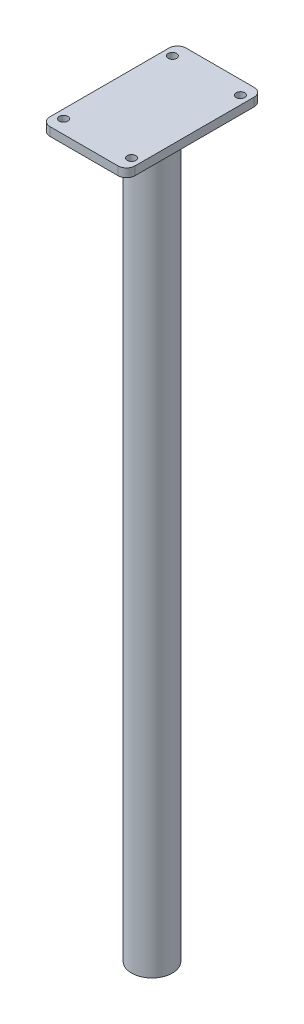
ISO-10303-21;
HEADER;
FILE_DESCRIPTION(('STEP AP214'),'2;1');
FILE_NAME('part.step','',(''),(''),'','','');
FILE_SCHEMA(('AUTOMOTIVE_DESIGN { 1 0 10303 214 1 1 1 1 }'));
ENDSEC;
DATA;
#1=APPLICATION_CONTEXT('core data for automotive mechanical design processes');
#2=APPLICATION_PROTOCOL_DEFINITION('international standard','automotive_design',2000,#1);
#3=PRODUCT_CONTEXT('',#1,'mechanical');
#4=PRODUCT('Part','Part','',(#3));
#5=PRODUCT_RELATED_PRODUCT_CATEGORY('part','',(#4));
#6=PRODUCT_DEFINITION_FORMATION('','',#4);
#7=PRODUCT_DEFINITION_CONTEXT('part definition',#1,'design');
#8=PRODUCT_DEFINITION('design','',#6,#7);
#9=PRODUCT_DEFINITION_SHAPE('','',#8);
#10=(LENGTH_UNIT() NAMED_UNIT(*) SI_UNIT(.MILLI.,.METRE.));
#11=(NAMED_UNIT(*) PLANE_ANGLE_UNIT() SI_UNIT($,.RADIAN.));
#12=(NAMED_UNIT(*) SI_UNIT($,.STERADIAN.) SOLID_ANGLE_UNIT());
#13=UNCERTAINTY_MEASURE_WITH_UNIT(LENGTH_MEASURE(1.E-05),#10,'distance_accuracy_value','');
#14=(GEOMETRIC_REPRESENTATION_CONTEXT(3) GLOBAL_UNCERTAINTY_ASSIGNED_CONTEXT((#13)) GLOBAL_UNIT_ASSIGNED_CONTEXT((#10,
#11,#12)) REPRESENTATION_CONTEXT('',''));
#15=CARTESIAN_POINT('',(0.,0.,0.));
#16=DIRECTION('',(0.,0.,1.));
#17=DIRECTION('',(1.,0.,0.));
#18=AXIS2_PLACEMENT_3D('',#15,#16,#17);
#19=CARTESIAN_POINT('',(0.,-430.,0.));
#20=DIRECTION('',(0.,1.,0.));
#21=DIRECTION('',(0.,0.,1.));
#22=AXIS2_PLACEMENT_3D('',#19,#20,#21);
#23=CYLINDRICAL_SURFACE('',#22,12.);
#24=CARTESIAN_POINT('',(0.,-430.,0.));
#25=DIRECTION('',(0.,1.,0.));
#26=DIRECTION('',(0.,0.,1.));
#27=AXIS2_PLACEMENT_3D('',#24,#25,#26);
#28=CIRCLE('',#27,12.);
#29=CARTESIAN_POINT('',(0.,-430.,12.));
#30=VERTEX_POINT('',#29);
#31=EDGE_CURVE('E11',#30,#30,#28,.T.);
#32=ORIENTED_EDGE('',*,*,#31,.T.);
#33=EDGE_LOOP('',(#32));
#34=FACE_BOUND('',#33,.T.);
#35=CARTESIAN_POINT('',(0.,0.,0.));
#36=DIRECTION('',(0.,1.,0.));
#37=DIRECTION('',(0.,0.,1.));
#38=AXIS2_PLACEMENT_3D('',#35,#36,#37);
#39=CIRCLE('',#38,12.);
#40=CARTESIAN_POINT('',(0.,0.,12.));
#41=VERTEX_POINT('',#40);
#42=EDGE_CURVE('E40',#41,#41,#39,.T.);
#43=ORIENTED_EDGE('',*,*,#42,.F.);
#44=EDGE_LOOP('',(#43));
#45=FACE_BOUND('',#44,.T.);
#46=ADVANCED_FACE('F37',(#34,#45),#23,.T.);
#47=CARTESIAN_POINT('',(0.,-430.,0.));
#48=DIRECTION('',(0.,1.,0.));
#49=DIRECTION('',(0.,0.,1.));
#50=AXIS2_PLACEMENT_3D('',#47,#48,#49);
#51=PLANE('',#50);
#52=CARTESIAN_POINT('',(0.,-430.,0.));
#53=DIRECTION('',(0.,-1.,0.));
#54=DIRECTION('',(0.,0.,-1.));
#55=AXIS2_PLACEMENT_3D('',#52,#53,#54);
#56=CIRCLE('',#55,5.);
#57=CARTESIAN_POINT('',(0.,-430.,-5.));
#58=VERTEX_POINT('',#57);
#59=EDGE_CURVE('E244',#58,#58,#56,.T.);
#60=ORIENTED_EDGE('',*,*,#59,.F.);
#61=EDGE_LOOP('',(#60));
#62=FACE_BOUND('',#61,.T.);
#63=ORIENTED_EDGE('',*,*,#31,.F.);
#64=EDGE_LOOP('',(#63));
#65=FACE_BOUND('',#64,.T.);
#66=ADVANCED_FACE('F172',(#62,#65),#51,.F.);
#67=CARTESIAN_POINT('',(20.,5.,35.));
#68=DIRECTION('',(0.,1.,0.));
#69=DIRECTION('',(0.,0.,1.));
#70=AXIS2_PLACEMENT_3D('',#67,#68,#69);
#71=PLANE('',#70);
#72=CARTESIAN_POINT('',(20.,5.,32.));
#73=DIRECTION('',(0.,1.,0.));
#74=DIRECTION('',(0.,0.,1.));
#75=AXIS2_PLACEMENT_3D('',#72,#73,#74);
#76=CIRCLE('',#75,2.5);
#77=CARTESIAN_POINT('',(20.,5.,34.5));
#78=VERTEX_POINT('',#77);
#79=EDGE_CURVE('E255',#78,#78,#76,.T.);
#80=ORIENTED_EDGE('',*,*,#79,.F.);
#81=EDGE_LOOP('',(#80));
#82=FACE_BOUND('',#81,.T.);
#83=CARTESIAN_POINT('',(-20.,5.,-32.));
#84=DIRECTION('',(0.,1.,0.));
#85=DIRECTION('',(0.,0.,1.));
#86=AXIS2_PLACEMENT_3D('',#83,#84,#85);
#87=CIRCLE('',#86,2.5);
#88=CARTESIAN_POINT('',(-20.,5.,-29.5));
#89=VERTEX_POINT('',#88);
#90=EDGE_CURVE('E139',#89,#89,#87,.T.);
#91=ORIENTED_EDGE('',*,*,#90,.F.);
#92=EDGE_LOOP('',(#91));
#93=FACE_BOUND('',#92,.T.);
#94=CARTESIAN_POINT('',(20.,5.,35.));
#95=DIRECTION('',(0.,1.,0.));
#96=DIRECTION('',(0.,0.,1.));
#97=AXIS2_PLACEMENT_3D('',#94,#95,#96);
#98=CIRCLE('',#97,5.);
#99=CARTESIAN_POINT('',(20.,5.,40.));
#100=VERTEX_POINT('',#99);
#101=CARTESIAN_POINT('',(25.,5.,35.));
#102=VERTEX_POINT('',#101);
#103=EDGE_CURVE('E150',#100,#102,#98,.T.);
#104=ORIENTED_EDGE('',*,*,#103,.T.);
#105=DIRECTION('',(0.,0.,-1.));
#106=VECTOR('',#105,1.);
#107=CARTESIAN_POINT('',(25.,5.,-35.));
#108=LINE('',#107,#106);
#109=CARTESIAN_POINT('',(25.,5.,-35.));
#110=VERTEX_POINT('',#109);
#111=EDGE_CURVE('E97',#102,#110,#108,.T.);
#112=ORIENTED_EDGE('',*,*,#111,.T.);
#113=CARTESIAN_POINT('',(20.,5.,-35.));
#114=DIRECTION('',(0.,1.,0.));
#115=DIRECTION('',(0.,0.,-1.));
#116=AXIS2_PLACEMENT_3D('',#113,#114,#115);
#117=CIRCLE('',#116,5.);
#118=CARTESIAN_POINT('',(20.,5.,-40.));
#119=VERTEX_POINT('',#118);
#120=EDGE_CURVE('E273',#110,#119,#117,.T.);
#121=ORIENTED_EDGE('',*,*,#120,.T.);
#122=DIRECTION('',(-1.,0.,0.));
#123=VECTOR('',#122,1.);
#124=CARTESIAN_POINT('',(-20.,5.,-40.));
#125=LINE('',#124,#123);
#126=CARTESIAN_POINT('',(-20.,5.,-40.));
#127=VERTEX_POINT('',#126);
#128=EDGE_CURVE('E275',#119,#127,#125,.T.);
#129=ORIENTED_EDGE('',*,*,#128,.T.);
#130=CARTESIAN_POINT('',(-20.,5.,-35.));
#131=DIRECTION('',(0.,1.,0.));
#132=DIRECTION('',(0.,0.,1.));
#133=AXIS2_PLACEMENT_3D('',#130,#131,#132);
#134=CIRCLE('',#133,5.);
#135=CARTESIAN_POINT('',(-25.,5.,-35.));
#136=VERTEX_POINT('',#135);
#137=EDGE_CURVE('E117',#127,#136,#134,.T.);
#138=ORIENTED_EDGE('',*,*,#137,.T.);
#139=DIRECTION('',(0.,0.,1.));
#140=VECTOR('',#139,1.);
#141=CARTESIAN_POINT('',(-25.,5.,-35.));
#142=LINE('',#141,#140);
#143=CARTESIAN_POINT('',(-25.,5.,35.));
#144=VERTEX_POINT('',#143);
#145=EDGE_CURVE('E110',#136,#144,#142,.T.);
#146=ORIENTED_EDGE('',*,*,#145,.T.);
#147=CARTESIAN_POINT('',(-20.,5.,35.));
#148=DIRECTION('',(0.,1.,0.));
#149=DIRECTION('',(0.,0.,-1.));
#150=AXIS2_PLACEMENT_3D('',#147,#148,#149);
#151=CIRCLE('',#150,5.);
#152=CARTESIAN_POINT('',(-20.,5.,40.));
#153=VERTEX_POINT('',#152);
#154=EDGE_CURVE('E115',#144,#153,#151,.T.);
#155=ORIENTED_EDGE('',*,*,#154,.T.);
#156=DIRECTION('',(1.,0.,0.));
#157=VECTOR('',#156,1.);
#158=CARTESIAN_POINT('',(-20.,5.,40.));
#159=LINE('',#158,#157);
#160=EDGE_CURVE('E53',#153,#100,#159,.T.);
#161=ORIENTED_EDGE('',*,*,#160,.T.);
#162=EDGE_LOOP('',(#104,#112,#121,#129,#138,#146,#155,#161));
#163=FACE_BOUND('',#162,.T.);
#164=CARTESIAN_POINT('',(-20.,5.,32.));
#165=DIRECTION('',(0.,1.,0.));
#166=DIRECTION('',(0.,0.,1.));
#167=AXIS2_PLACEMENT_3D('',#164,#165,#166);
#168=CIRCLE('',#167,2.5);
#169=CARTESIAN_POINT('',(-20.,5.,34.5));
#170=VERTEX_POINT('',#169);
#171=EDGE_CURVE('E261',#170,#170,#168,.T.);
#172=ORIENTED_EDGE('',*,*,#171,.F.);
#173=EDGE_LOOP('',(#172));
#174=FACE_BOUND('',#173,.T.);
#175=CARTESIAN_POINT('',(20.,5.,-32.));
#176=DIRECTION('',(0.,1.,0.));
#177=DIRECTION('',(0.,0.,1.));
#178=AXIS2_PLACEMENT_3D('',#175,#176,#177);
#179=CIRCLE('',#178,2.5);
#180=CARTESIAN_POINT('',(20.,5.,-29.5));
#181=VERTEX_POINT('',#180);
#182=EDGE_CURVE('E247',#181,#181,#179,.T.);
#183=ORIENTED_EDGE('',*,*,#182,.F.);
#184=EDGE_LOOP('',(#183));
#185=FACE_BOUND('',#184,.T.);
#186=ADVANCED_FACE('F112',(#82,#93,#163,#174,#185),#71,.T.);
#187=CARTESIAN_POINT('',(20.,0.,35.));
#188=DIRECTION('',(0.,1.,0.));
#189=DIRECTION('',(0.,0.,1.));
#190=AXIS2_PLACEMENT_3D('',#187,#188,#189);
#191=PLANE('',#190);
#192=ORIENTED_EDGE('',*,*,#42,.T.);
#193=EDGE_LOOP('',(#192));
#194=FACE_BOUND('',#193,.T.);
#195=CARTESIAN_POINT('',(20.,0.,35.));
#196=DIRECTION('',(0.,1.,0.));
#197=DIRECTION('',(0.,0.,1.));
#198=AXIS2_PLACEMENT_3D('',#195,#196,#197);
#199=CIRCLE('',#198,5.);
#200=CARTESIAN_POINT('',(20.,0.,40.));
#201=VERTEX_POINT('',#200);
#202=CARTESIAN_POINT('',(25.,0.,35.));
#203=VERTEX_POINT('',#202);
#204=EDGE_CURVE('E135',#201,#203,#199,.T.);
#205=ORIENTED_EDGE('',*,*,#204,.F.);
#206=DIRECTION('',(1.,0.,0.));
#207=VECTOR('',#206,1.);
#208=CARTESIAN_POINT('',(-20.,0.,40.));
#209=LINE('',#208,#207);
#210=CARTESIAN_POINT('',(-20.,0.,40.));
#211=VERTEX_POINT('',#210);
#212=EDGE_CURVE('E88',#211,#201,#209,.T.);
#213=ORIENTED_EDGE('',*,*,#212,.F.);
#214=CARTESIAN_POINT('',(-20.,0.,35.));
#215=DIRECTION('',(0.,1.,0.));
#216=DIRECTION('',(0.,0.,-1.));
#217=AXIS2_PLACEMENT_3D('',#214,#215,#216);
#218=CIRCLE('',#217,5.);
#219=CARTESIAN_POINT('',(-25.,0.,35.));
#220=VERTEX_POINT('',#219);
#221=EDGE_CURVE('E82',#220,#211,#218,.T.);
#222=ORIENTED_EDGE('',*,*,#221,.F.);
#223=DIRECTION('',(0.,0.,1.));
#224=VECTOR('',#223,1.);
#225=CARTESIAN_POINT('',(-25.,0.,-35.));
#226=LINE('',#225,#224);
#227=CARTESIAN_POINT('',(-25.,0.,-35.));
#228=VERTEX_POINT('',#227);
#229=EDGE_CURVE('E125',#228,#220,#226,.T.);
#230=ORIENTED_EDGE('',*,*,#229,.F.);
#231=CARTESIAN_POINT('',(-20.,0.,-35.));
#232=DIRECTION('',(0.,1.,0.));
#233=DIRECTION('',(0.,0.,1.));
#234=AXIS2_PLACEMENT_3D('',#231,#232,#233);
#235=CIRCLE('',#234,5.);
#236=CARTESIAN_POINT('',(-20.,0.,-40.));
#237=VERTEX_POINT('',#236);
#238=EDGE_CURVE('E145',#237,#228,#235,.T.);
#239=ORIENTED_EDGE('',*,*,#238,.F.);
#240=DIRECTION('',(-1.,0.,0.));
#241=VECTOR('',#240,1.);
#242=CARTESIAN_POINT('',(-20.,0.,-40.));
#243=LINE('',#242,#241);
#244=CARTESIAN_POINT('',(20.,0.,-40.));
#245=VERTEX_POINT('',#244);
#246=EDGE_CURVE('E143',#245,#237,#243,.T.);
#247=ORIENTED_EDGE('',*,*,#246,.F.);
#248=CARTESIAN_POINT('',(20.,0.,-35.));
#249=DIRECTION('',(0.,1.,0.));
#250=DIRECTION('',(0.,0.,-1.));
#251=AXIS2_PLACEMENT_3D('',#248,#249,#250);
#252=CIRCLE('',#251,5.);
#253=CARTESIAN_POINT('',(25.,0.,-35.));
#254=VERTEX_POINT('',#253);
#255=EDGE_CURVE('E141',#254,#245,#252,.T.);
#256=ORIENTED_EDGE('',*,*,#255,.F.);
#257=DIRECTION('',(0.,0.,-1.));
#258=VECTOR('',#257,1.);
#259=CARTESIAN_POINT('',(25.,0.,-35.));
#260=LINE('',#259,#258);
#261=EDGE_CURVE('E138',#203,#254,#260,.T.);
#262=ORIENTED_EDGE('',*,*,#261,.F.);
#263=EDGE_LOOP('',(#205,#213,#222,#230,#239,#247,#256,#262));
#264=FACE_BOUND('',#263,.T.);
#265=CARTESIAN_POINT('',(-20.,0.,-32.));
#266=DIRECTION('',(0.,1.,0.));
#267=DIRECTION('',(0.,0.,1.));
#268=AXIS2_PLACEMENT_3D('',#265,#266,#267);
#269=CIRCLE('',#268,2.5);
#270=CARTESIAN_POINT('',(-20.,0.,-29.5));
#271=VERTEX_POINT('',#270);
#272=EDGE_CURVE('E264',#271,#271,#269,.T.);
#273=ORIENTED_EDGE('',*,*,#272,.T.);
#274=EDGE_LOOP('',(#273));
#275=FACE_BOUND('',#274,.T.);
#276=CARTESIAN_POINT('',(-20.,0.,32.));
#277=DIRECTION('',(0.,1.,0.));
#278=DIRECTION('',(0.,0.,1.));
#279=AXIS2_PLACEMENT_3D('',#276,#277,#278);
#280=CIRCLE('',#279,2.5);
#281=CARTESIAN_POINT('',(-20.,0.,34.5));
#282=VERTEX_POINT('',#281);
#283=EDGE_CURVE('E258',#282,#282,#280,.T.);
#284=ORIENTED_EDGE('',*,*,#283,.T.);
#285=EDGE_LOOP('',(#284));
#286=FACE_BOUND('',#285,.T.);
#287=CARTESIAN_POINT('',(20.,0.,32.));
#288=DIRECTION('',(0.,1.,0.));
#289=DIRECTION('',(0.,0.,1.));
#290=AXIS2_PLACEMENT_3D('',#287,#288,#289);
#291=CIRCLE('',#290,2.5);
#292=CARTESIAN_POINT('',(20.,0.,34.5));
#293=VERTEX_POINT('',#292);
#294=EDGE_CURVE('E253',#293,#293,#291,.T.);
#295=ORIENTED_EDGE('',*,*,#294,.T.);
#296=EDGE_LOOP('',(#295));
#297=FACE_BOUND('',#296,.T.);
#298=CARTESIAN_POINT('',(20.,0.,-32.));
#299=DIRECTION('',(0.,1.,0.));
#300=DIRECTION('',(0.,0.,1.));
#301=AXIS2_PLACEMENT_3D('',#298,#299,#300);
#302=CIRCLE('',#301,2.5);
#303=CARTESIAN_POINT('',(20.,0.,-29.5));
#304=VERTEX_POINT('',#303);
#305=EDGE_CURVE('E243',#304,#304,#302,.T.);
#306=ORIENTED_EDGE('',*,*,#305,.T.);
#307=EDGE_LOOP('',(#306));
#308=FACE_BOUND('',#307,.T.);
#309=ADVANCED_FACE('F168',(#194,#264,#275,#286,#297,#308),#191,.F.);
#310=CARTESIAN_POINT('',(20.,5.,35.));
#311=DIRECTION('',(0.,-1.,0.));
#312=DIRECTION('',(0.,0.,-1.));
#313=AXIS2_PLACEMENT_3D('',#310,#311,#312);
#314=CYLINDRICAL_SURFACE('',#313,5.);
#315=ORIENTED_EDGE('',*,*,#204,.T.);
#316=DIRECTION('',(0.,-1.,0.));
#317=VECTOR('',#316,1.);
#318=CARTESIAN_POINT('',(25.,5.,35.));
#319=LINE('',#318,#317);
#320=EDGE_CURVE('E163',#102,#203,#319,.T.);
#321=ORIENTED_EDGE('',*,*,#320,.F.);
#322=ORIENTED_EDGE('',*,*,#103,.F.);
#323=DIRECTION('',(0.,-1.,0.));
#324=VECTOR('',#323,1.);
#325=CARTESIAN_POINT('',(20.,5.,40.));
#326=LINE('',#325,#324);
#327=EDGE_CURVE('E131',#100,#201,#326,.T.);
#328=ORIENTED_EDGE('',*,*,#327,.T.);
#329=EDGE_LOOP('',(#315,#321,#322,#328));
#330=FACE_BOUND('',#329,.T.);
#331=ADVANCED_FACE('F187',(#330),#314,.T.);
#332=CARTESIAN_POINT('',(25.,5.,-35.));
#333=DIRECTION('',(-1.,0.,0.));
#334=DIRECTION('',(0.,0.,1.));
#335=AXIS2_PLACEMENT_3D('',#332,#333,#334);
#336=PLANE('',#335);
#337=ORIENTED_EDGE('',*,*,#261,.T.);
#338=DIRECTION('',(0.,-1.,0.));
#339=VECTOR('',#338,1.);
#340=CARTESIAN_POINT('',(25.,5.,-35.));
#341=LINE('',#340,#339);
#342=EDGE_CURVE('E160',#110,#254,#341,.T.);
#343=ORIENTED_EDGE('',*,*,#342,.F.);
#344=ORIENTED_EDGE('',*,*,#111,.F.);
#345=ORIENTED_EDGE('',*,*,#320,.T.);
#346=EDGE_LOOP('',(#337,#343,#344,#345));
#347=FACE_BOUND('',#346,.T.);
#348=ADVANCED_FACE('F190',(#347),#336,.F.);
#349=CARTESIAN_POINT('',(20.,5.,-35.));
#350=DIRECTION('',(0.,-1.,0.));
#351=DIRECTION('',(0.,0.,-1.));
#352=AXIS2_PLACEMENT_3D('',#349,#350,#351);
#353=CYLINDRICAL_SURFACE('',#352,5.);
#354=ORIENTED_EDGE('',*,*,#255,.T.);
#355=DIRECTION('',(0.,-1.,0.));
#356=VECTOR('',#355,1.);
#357=CARTESIAN_POINT('',(20.,5.,-40.));
#358=LINE('',#357,#356);
#359=EDGE_CURVE('E157',#119,#245,#358,.T.);
#360=ORIENTED_EDGE('',*,*,#359,.F.);
#361=ORIENTED_EDGE('',*,*,#120,.F.);
#362=ORIENTED_EDGE('',*,*,#342,.T.);
#363=EDGE_LOOP('',(#354,#360,#361,#362));
#364=FACE_BOUND('',#363,.T.);
#365=ADVANCED_FACE('F194',(#364),#353,.T.);
#366=CARTESIAN_POINT('',(-20.,5.,-40.));
#367=DIRECTION('',(0.,0.,1.));
#368=DIRECTION('',(1.,0.,0.));
#369=AXIS2_PLACEMENT_3D('',#366,#367,#368);
#370=PLANE('',#369);
#371=ORIENTED_EDGE('',*,*,#246,.T.);
#372=DIRECTION('',(0.,-1.,0.));
#373=VECTOR('',#372,1.);
#374=CARTESIAN_POINT('',(-20.,5.,-40.));
#375=LINE('',#374,#373);
#376=EDGE_CURVE('E154',#127,#237,#375,.T.);
#377=ORIENTED_EDGE('',*,*,#376,.F.);
#378=ORIENTED_EDGE('',*,*,#128,.F.);
#379=ORIENTED_EDGE('',*,*,#359,.T.);
#380=EDGE_LOOP('',(#371,#377,#378,#379));
#381=FACE_BOUND('',#380,.T.);
#382=ADVANCED_FACE('F197',(#381),#370,.F.);
#383=CARTESIAN_POINT('',(-20.,5.,-35.));
#384=DIRECTION('',(0.,-1.,0.));
#385=DIRECTION('',(0.,0.,-1.));
#386=AXIS2_PLACEMENT_3D('',#383,#384,#385);
#387=CYLINDRICAL_SURFACE('',#386,5.);
#388=ORIENTED_EDGE('',*,*,#238,.T.);
#389=DIRECTION('',(0.,-1.,0.));
#390=VECTOR('',#389,1.);
#391=CARTESIAN_POINT('',(-25.,5.,-35.));
#392=LINE('',#391,#390);
#393=EDGE_CURVE('E126',#136,#228,#392,.T.);
#394=ORIENTED_EDGE('',*,*,#393,.F.);
#395=ORIENTED_EDGE('',*,*,#137,.F.);
#396=ORIENTED_EDGE('',*,*,#376,.T.);
#397=EDGE_LOOP('',(#388,#394,#395,#396));
#398=FACE_BOUND('',#397,.T.);
#399=ADVANCED_FACE('F201',(#398),#387,.T.);
#400=CARTESIAN_POINT('',(-25.,5.,-35.));
#401=DIRECTION('',(1.,0.,0.));
#402=DIRECTION('',(0.,0.,-1.));
#403=AXIS2_PLACEMENT_3D('',#400,#401,#402);
#404=PLANE('',#403);
#405=ORIENTED_EDGE('',*,*,#229,.T.);
#406=DIRECTION('',(0.,-1.,0.));
#407=VECTOR('',#406,1.);
#408=CARTESIAN_POINT('',(-25.,5.,35.));
#409=LINE('',#408,#407);
#410=EDGE_CURVE('E122',#144,#220,#409,.T.);
#411=ORIENTED_EDGE('',*,*,#410,.F.);
#412=ORIENTED_EDGE('',*,*,#145,.F.);
#413=ORIENTED_EDGE('',*,*,#393,.T.);
#414=EDGE_LOOP('',(#405,#411,#412,#413));
#415=FACE_BOUND('',#414,.T.);
#416=ADVANCED_FACE('F123',(#415),#404,.F.);
#417=CARTESIAN_POINT('',(-20.,5.,35.));
#418=DIRECTION('',(0.,-1.,0.));
#419=DIRECTION('',(0.,0.,-1.));
#420=AXIS2_PLACEMENT_3D('',#417,#418,#419);
#421=CYLINDRICAL_SURFACE('',#420,5.);
#422=ORIENTED_EDGE('',*,*,#221,.T.);
#423=DIRECTION('',(0.,-1.,0.));
#424=VECTOR('',#423,1.);
#425=CARTESIAN_POINT('',(-20.,5.,40.));
#426=LINE('',#425,#424);
#427=EDGE_CURVE('E127',#153,#211,#426,.T.);
#428=ORIENTED_EDGE('',*,*,#427,.F.);
#429=ORIENTED_EDGE('',*,*,#154,.F.);
#430=ORIENTED_EDGE('',*,*,#410,.T.);
#431=EDGE_LOOP('',(#422,#428,#429,#430));
#432=FACE_BOUND('',#431,.T.);
#433=ADVANCED_FACE('F129',(#432),#421,.T.);
#434=CARTESIAN_POINT('',(-20.,5.,40.));
#435=DIRECTION('',(0.,0.,-1.));
#436=DIRECTION('',(-1.,0.,0.));
#437=AXIS2_PLACEMENT_3D('',#434,#435,#436);
#438=PLANE('',#437);
#439=ORIENTED_EDGE('',*,*,#212,.T.);
#440=ORIENTED_EDGE('',*,*,#327,.F.);
#441=ORIENTED_EDGE('',*,*,#160,.F.);
#442=ORIENTED_EDGE('',*,*,#427,.T.);
#443=EDGE_LOOP('',(#439,#440,#441,#442));
#444=FACE_BOUND('',#443,.T.);
#445=ADVANCED_FACE('F210',(#444),#438,.F.);
#446=CARTESIAN_POINT('',(-20.,5.,-32.));
#447=DIRECTION('',(0.,-1.,0.));
#448=DIRECTION('',(0.,0.,-1.));
#449=AXIS2_PLACEMENT_3D('',#446,#447,#448);
#450=CYLINDRICAL_SURFACE('',#449,2.5);
#451=ORIENTED_EDGE('',*,*,#90,.T.);
#452=EDGE_LOOP('',(#451));
#453=FACE_BOUND('',#452,.T.);
#454=ORIENTED_EDGE('',*,*,#272,.F.);
#455=EDGE_LOOP('',(#454));
#456=FACE_BOUND('',#455,.T.);
#457=ADVANCED_FACE('F213',(#453,#456),#450,.F.);
#458=CARTESIAN_POINT('',(-20.,5.,32.));
#459=DIRECTION('',(0.,-1.,0.));
#460=DIRECTION('',(0.,0.,-1.));
#461=AXIS2_PLACEMENT_3D('',#458,#459,#460);
#462=CYLINDRICAL_SURFACE('',#461,2.5);
#463=ORIENTED_EDGE('',*,*,#171,.T.);
#464=EDGE_LOOP('',(#463));
#465=FACE_BOUND('',#464,.T.);
#466=ORIENTED_EDGE('',*,*,#283,.F.);
#467=EDGE_LOOP('',(#466));
#468=FACE_BOUND('',#467,.T.);
#469=ADVANCED_FACE('F218',(#465,#468),#462,.F.);
#470=CARTESIAN_POINT('',(20.,5.,32.));
#471=DIRECTION('',(0.,-1.,0.));
#472=DIRECTION('',(0.,0.,-1.));
#473=AXIS2_PLACEMENT_3D('',#470,#471,#472);
#474=CYLINDRICAL_SURFACE('',#473,2.5);
#475=ORIENTED_EDGE('',*,*,#79,.T.);
#476=EDGE_LOOP('',(#475));
#477=FACE_BOUND('',#476,.T.);
#478=ORIENTED_EDGE('',*,*,#294,.F.);
#479=EDGE_LOOP('',(#478));
#480=FACE_BOUND('',#479,.T.);
#481=ADVANCED_FACE('F222',(#477,#480),#474,.F.);
#482=CARTESIAN_POINT('',(20.,5.,-32.));
#483=DIRECTION('',(0.,-1.,0.));
#484=DIRECTION('',(0.,0.,-1.));
#485=AXIS2_PLACEMENT_3D('',#482,#483,#484);
#486=CYLINDRICAL_SURFACE('',#485,2.5);
#487=ORIENTED_EDGE('',*,*,#182,.T.);
#488=EDGE_LOOP('',(#487));
#489=FACE_BOUND('',#488,.T.);
#490=ORIENTED_EDGE('',*,*,#305,.F.);
#491=EDGE_LOOP('',(#490));
#492=FACE_BOUND('',#491,.T.);
#493=ADVANCED_FACE('F226',(#489,#492),#486,.F.);
#494=CARTESIAN_POINT('',(0.,-380.,0.));
#495=DIRECTION('',(0.,-1.,0.));
#496=DIRECTION('',(0.,0.,-1.));
#497=AXIS2_PLACEMENT_3D('',#494,#495,#496);
#498=CYLINDRICAL_SURFACE('',#497,5.);
#499=CARTESIAN_POINT('',(0.,-380.,0.));
#500=DIRECTION('',(0.,-1.,0.));
#501=DIRECTION('',(0.,0.,-1.));
#502=AXIS2_PLACEMENT_3D('',#499,#500,#501);
#503=CIRCLE('',#502,5.);
#504=CARTESIAN_POINT('',(0.,-380.,-5.));
#505=VERTEX_POINT('',#504);
#506=EDGE_CURVE('E242',#505,#505,#503,.T.);
#507=ORIENTED_EDGE('',*,*,#506,.F.);
#508=EDGE_LOOP('',(#507));
#509=FACE_BOUND('',#508,.T.);
#510=ORIENTED_EDGE('',*,*,#59,.T.);
#511=EDGE_LOOP('',(#510));
#512=FACE_BOUND('',#511,.T.);
#513=ADVANCED_FACE('F230',(#509,#512),#498,.F.);
#514=CARTESIAN_POINT('',(0.,-380.,0.));
#515=DIRECTION('',(0.,-1.,0.));
#516=DIRECTION('',(0.,0.,-1.));
#517=AXIS2_PLACEMENT_3D('',#514,#515,#516);
#518=PLANE('',#517);
#519=ORIENTED_EDGE('',*,*,#506,.T.);
#520=EDGE_LOOP('',(#519));
#521=FACE_BOUND('',#520,.T.);
#522=ADVANCED_FACE('F234',(#521),#518,.T.);
#523=CLOSED_SHELL('',(#46,#66,#186,#309,#331,#348,#365,#382,#399,#416,#433,#445,#457,#469,#481,
#493,#513,#522));
#524=MANIFOLD_SOLID_BREP('B2',#523);
#525=ADVANCED_BREP_SHAPE_REPRESENTATION('',(#18,#524),#14);
#526=SHAPE_DEFINITION_REPRESENTATION(#9,#525);
ENDSEC;
END-ISO-10303-21;
